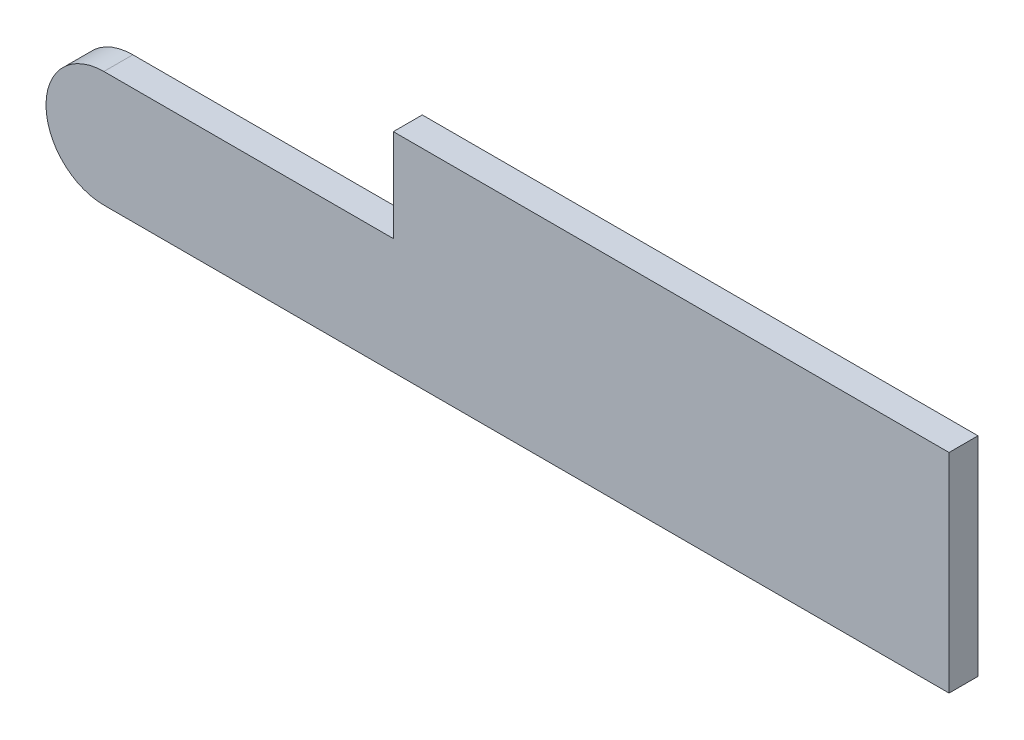
ISO-10303-21;
HEADER;
FILE_DESCRIPTION(('STEP AP214'),'2;1');
FILE_NAME('part.step','',(''),(''),'','','');
FILE_SCHEMA(('AUTOMOTIVE_DESIGN { 1 0 10303 214 1 1 1 1 }'));
ENDSEC;
DATA;
#1=APPLICATION_CONTEXT('core data for automotive mechanical design processes');
#2=APPLICATION_PROTOCOL_DEFINITION('international standard','automotive_design',2000,#1);
#3=PRODUCT_CONTEXT('',#1,'mechanical');
#4=PRODUCT('Part','Part','',(#3));
#5=PRODUCT_RELATED_PRODUCT_CATEGORY('part','',(#4));
#6=PRODUCT_DEFINITION_FORMATION('','',#4);
#7=PRODUCT_DEFINITION_CONTEXT('part definition',#1,'design');
#8=PRODUCT_DEFINITION('design','',#6,#7);
#9=PRODUCT_DEFINITION_SHAPE('','',#8);
#10=(LENGTH_UNIT() NAMED_UNIT(*) SI_UNIT(.MILLI.,.METRE.));
#11=(NAMED_UNIT(*) PLANE_ANGLE_UNIT() SI_UNIT($,.RADIAN.));
#12=(NAMED_UNIT(*) SI_UNIT($,.STERADIAN.) SOLID_ANGLE_UNIT());
#13=UNCERTAINTY_MEASURE_WITH_UNIT(LENGTH_MEASURE(1.E-05),#10,'distance_accuracy_value','');
#14=(GEOMETRIC_REPRESENTATION_CONTEXT(3) GLOBAL_UNCERTAINTY_ASSIGNED_CONTEXT((#13)) GLOBAL_UNIT_ASSIGNED_CONTEXT((#10,
#11,#12)) REPRESENTATION_CONTEXT('',''));
#15=CARTESIAN_POINT('',(0.,0.,0.));
#16=DIRECTION('',(0.,0.,1.));
#17=DIRECTION('',(1.,0.,0.));
#18=AXIS2_PLACEMENT_3D('',#15,#16,#17);
#19=CARTESIAN_POINT('',(0.,0.,-0.25));
#20=DIRECTION('',(0.,0.,1.));
#21=DIRECTION('',(1.,0.,0.));
#22=AXIS2_PLACEMENT_3D('',#19,#20,#21);
#23=PLANE('',#22);
#24=CARTESIAN_POINT('',(-2.5,0.5,-0.25));
#25=DIRECTION('',(0.,0.,1.));
#26=DIRECTION('',(1.,0.,0.));
#27=AXIS2_PLACEMENT_3D('',#24,#25,#26);
#28=CIRCLE('',#27,0.5);
#29=CARTESIAN_POINT('',(-2.5,0.999999999999999,-0.25));
#30=VERTEX_POINT('',#29);
#31=CARTESIAN_POINT('',(-2.5,0.,-0.25));
#32=VERTEX_POINT('',#31);
#33=EDGE_CURVE('E20',#30,#32,#28,.T.);
#34=ORIENTED_EDGE('',*,*,#33,.F.);
#35=DIRECTION('',(1.,0.,0.));
#36=VECTOR('',#35,1.);
#37=CARTESIAN_POINT('',(-3.,0.999999999999999,-0.25));
#38=LINE('',#37,#36);
#39=CARTESIAN_POINT('',(0.,0.999999999999999,-0.25));
#40=VERTEX_POINT('',#39);
#41=EDGE_CURVE('E96',#40,#30,#38,.F.);
#42=ORIENTED_EDGE('',*,*,#41,.F.);
#43=DIRECTION('',(0.,1.,0.));
#44=VECTOR('',#43,1.);
#45=CARTESIAN_POINT('',(0.,0.999999999999999,-0.25));
#46=LINE('',#45,#44);
#47=CARTESIAN_POINT('',(0.,1.8,-0.25));
#48=VERTEX_POINT('',#47);
#49=EDGE_CURVE('E94',#48,#40,#46,.F.);
#50=ORIENTED_EDGE('',*,*,#49,.F.);
#51=DIRECTION('',(-1.,0.,0.));
#52=VECTOR('',#51,1.);
#53=CARTESIAN_POINT('',(0.,1.8,-0.25));
#54=LINE('',#53,#52);
#55=CARTESIAN_POINT('',(4.8,1.8,-0.25));
#56=VERTEX_POINT('',#55);
#57=EDGE_CURVE('E103',#56,#48,#54,.T.);
#58=ORIENTED_EDGE('',*,*,#57,.F.);
#59=DIRECTION('',(0.,1.,0.));
#60=VECTOR('',#59,1.);
#61=CARTESIAN_POINT('',(4.8,0.,-0.25));
#62=LINE('',#61,#60);
#63=CARTESIAN_POINT('',(4.8,0.,-0.25));
#64=VERTEX_POINT('',#63);
#65=EDGE_CURVE('E81',#64,#56,#62,.T.);
#66=ORIENTED_EDGE('',*,*,#65,.F.);
#67=DIRECTION('',(1.,0.,0.));
#68=VECTOR('',#67,1.);
#69=CARTESIAN_POINT('',(0.,0.,-0.25));
#70=LINE('',#69,#68);
#71=EDGE_CURVE('E79',#32,#64,#70,.T.);
#72=ORIENTED_EDGE('',*,*,#71,.F.);
#73=EDGE_LOOP('',(#34,#42,#50,#58,#66,#72));
#74=FACE_BOUND('',#73,.T.);
#75=ADVANCED_FACE('F17',(#74),#23,.F.);
#76=CARTESIAN_POINT('',(-2.5,0.5,-0.25));
#77=DIRECTION('',(0.,0.,1.));
#78=DIRECTION('',(1.,0.,0.));
#79=AXIS2_PLACEMENT_3D('',#76,#77,#78);
#80=CYLINDRICAL_SURFACE('',#79,0.5);
#81=DIRECTION('',(0.,0.,-1.));
#82=VECTOR('',#81,1.);
#83=CARTESIAN_POINT('',(-2.5,0.,-0.25));
#84=LINE('',#83,#82);
#85=CARTESIAN_POINT('',(-2.5,0.,0.));
#86=VERTEX_POINT('',#85);
#87=EDGE_CURVE('E72',#86,#32,#84,.T.);
#88=ORIENTED_EDGE('',*,*,#87,.F.);
#89=CARTESIAN_POINT('',(-2.5,0.499999999999999,0.));
#90=DIRECTION('',(0.,0.,1.));
#91=DIRECTION('',(1.,0.,0.));
#92=AXIS2_PLACEMENT_3D('',#89,#90,#91);
#93=CIRCLE('',#92,0.5);
#94=CARTESIAN_POINT('',(-2.5,0.999999999999999,0.));
#95=VERTEX_POINT('',#94);
#96=EDGE_CURVE('E112',#95,#86,#93,.T.);
#97=ORIENTED_EDGE('',*,*,#96,.F.);
#98=DIRECTION('',(0.,0.,1.));
#99=VECTOR('',#98,1.);
#100=CARTESIAN_POINT('',(-2.5,0.999999999999999,-0.25));
#101=LINE('',#100,#99);
#102=EDGE_CURVE('E75',#30,#95,#101,.T.);
#103=ORIENTED_EDGE('',*,*,#102,.F.);
#104=ORIENTED_EDGE('',*,*,#33,.T.);
#105=EDGE_LOOP('',(#88,#97,#103,#104));
#106=FACE_BOUND('',#105,.T.);
#107=ADVANCED_FACE('F70',(#106),#80,.T.);
#108=CARTESIAN_POINT('',(0.,0.,-0.25));
#109=DIRECTION('',(0.,-1.,0.));
#110=DIRECTION('',(0.,0.,-1.));
#111=AXIS2_PLACEMENT_3D('',#108,#109,#110);
#112=PLANE('',#111);
#113=ORIENTED_EDGE('',*,*,#71,.T.);
#114=DIRECTION('',(0.,0.,-1.));
#115=VECTOR('',#114,1.);
#116=CARTESIAN_POINT('',(4.8,0.,-0.25));
#117=LINE('',#116,#115);
#118=CARTESIAN_POINT('',(4.8,0.,0.));
#119=VERTEX_POINT('',#118);
#120=EDGE_CURVE('E84',#119,#64,#117,.T.);
#121=ORIENTED_EDGE('',*,*,#120,.F.);
#122=DIRECTION('',(1.,0.,0.));
#123=VECTOR('',#122,1.);
#124=CARTESIAN_POINT('',(0.,0.,0.));
#125=LINE('',#124,#123);
#126=EDGE_CURVE('E88',#86,#119,#125,.T.);
#127=ORIENTED_EDGE('',*,*,#126,.F.);
#128=ORIENTED_EDGE('',*,*,#87,.T.);
#129=EDGE_LOOP('',(#113,#121,#127,#128));
#130=FACE_BOUND('',#129,.T.);
#131=ADVANCED_FACE('F86',(#130),#112,.T.);
#132=CARTESIAN_POINT('',(4.8,0.,-0.25));
#133=DIRECTION('',(1.,0.,0.));
#134=DIRECTION('',(0.,0.,-1.));
#135=AXIS2_PLACEMENT_3D('',#132,#133,#134);
#136=PLANE('',#135);
#137=ORIENTED_EDGE('',*,*,#65,.T.);
#138=DIRECTION('',(0.,0.,1.));
#139=VECTOR('',#138,1.);
#140=CARTESIAN_POINT('',(4.8,1.8,-0.25));
#141=LINE('',#140,#139);
#142=CARTESIAN_POINT('',(4.8,1.8,0.));
#143=VERTEX_POINT('',#142);
#144=EDGE_CURVE('E105',#143,#56,#141,.F.);
#145=ORIENTED_EDGE('',*,*,#144,.F.);
#146=DIRECTION('',(0.,1.,0.));
#147=VECTOR('',#146,1.);
#148=CARTESIAN_POINT('',(4.8,0.,0.));
#149=LINE('',#148,#147);
#150=EDGE_CURVE('E114',#119,#143,#149,.T.);
#151=ORIENTED_EDGE('',*,*,#150,.F.);
#152=ORIENTED_EDGE('',*,*,#120,.T.);
#153=EDGE_LOOP('',(#137,#145,#151,#152));
#154=FACE_BOUND('',#153,.T.);
#155=ADVANCED_FACE('F145',(#154),#136,.T.);
#156=CARTESIAN_POINT('',(0.,1.8,-0.25));
#157=DIRECTION('',(0.,1.,0.));
#158=DIRECTION('',(-1.,0.,0.));
#159=AXIS2_PLACEMENT_3D('',#156,#157,#158);
#160=PLANE('',#159);
#161=ORIENTED_EDGE('',*,*,#57,.T.);
#162=DIRECTION('',(0.,0.,1.));
#163=VECTOR('',#162,1.);
#164=CARTESIAN_POINT('',(0.,1.8,-0.25));
#165=LINE('',#164,#163);
#166=CARTESIAN_POINT('',(0.,1.8,0.));
#167=VERTEX_POINT('',#166);
#168=EDGE_CURVE('E97',#167,#48,#165,.F.);
#169=ORIENTED_EDGE('',*,*,#168,.F.);
#170=DIRECTION('',(1.,0.,0.));
#171=VECTOR('',#170,1.);
#172=CARTESIAN_POINT('',(0.,1.8,0.));
#173=LINE('',#172,#171);
#174=EDGE_CURVE('E125',#143,#167,#173,.F.);
#175=ORIENTED_EDGE('',*,*,#174,.F.);
#176=ORIENTED_EDGE('',*,*,#144,.T.);
#177=EDGE_LOOP('',(#161,#169,#175,#176));
#178=FACE_BOUND('',#177,.T.);
#179=ADVANCED_FACE('F160',(#178),#160,.T.);
#180=CARTESIAN_POINT('',(0.,0.999999999999999,-0.25));
#181=DIRECTION('',(-1.,0.,0.));
#182=DIRECTION('',(0.,0.,1.));
#183=AXIS2_PLACEMENT_3D('',#180,#181,#182);
#184=PLANE('',#183);
#185=ORIENTED_EDGE('',*,*,#49,.T.);
#186=DIRECTION('',(0.,0.,1.));
#187=VECTOR('',#186,1.);
#188=CARTESIAN_POINT('',(0.,0.999999999999999,-0.25));
#189=LINE('',#188,#187);
#190=CARTESIAN_POINT('',(0.,0.999999999999999,0.));
#191=VERTEX_POINT('',#190);
#192=EDGE_CURVE('E35',#191,#40,#189,.F.);
#193=ORIENTED_EDGE('',*,*,#192,.F.);
#194=DIRECTION('',(0.,1.,0.));
#195=VECTOR('',#194,1.);
#196=CARTESIAN_POINT('',(0.,0.,0.));
#197=LINE('',#196,#195);
#198=EDGE_CURVE('E26',#167,#191,#197,.F.);
#199=ORIENTED_EDGE('',*,*,#198,.F.);
#200=ORIENTED_EDGE('',*,*,#168,.T.);
#201=EDGE_LOOP('',(#185,#193,#199,#200));
#202=FACE_BOUND('',#201,.T.);
#203=ADVANCED_FACE('F155',(#202),#184,.T.);
#204=CARTESIAN_POINT('',(-3.,0.999999999999999,-0.25));
#205=DIRECTION('',(0.,1.,0.));
#206=DIRECTION('',(0.,0.,1.));
#207=AXIS2_PLACEMENT_3D('',#204,#205,#206);
#208=PLANE('',#207);
#209=DIRECTION('',(1.,0.,0.));
#210=VECTOR('',#209,1.);
#211=CARTESIAN_POINT('',(0.,0.999999999999999,0.));
#212=LINE('',#211,#210);
#213=EDGE_CURVE('E11',#191,#95,#212,.F.);
#214=ORIENTED_EDGE('',*,*,#213,.F.);
#215=ORIENTED_EDGE('',*,*,#192,.T.);
#216=ORIENTED_EDGE('',*,*,#41,.T.);
#217=ORIENTED_EDGE('',*,*,#102,.T.);
#218=EDGE_LOOP('',(#214,#215,#216,#217));
#219=FACE_BOUND('',#218,.T.);
#220=ADVANCED_FACE('F149',(#219),#208,.T.);
#221=CARTESIAN_POINT('',(0.,0.,0.));
#222=DIRECTION('',(0.,0.,1.));
#223=DIRECTION('',(1.,0.,0.));
#224=AXIS2_PLACEMENT_3D('',#221,#222,#223);
#225=PLANE('',#224);
#226=ORIENTED_EDGE('',*,*,#198,.T.);
#227=ORIENTED_EDGE('',*,*,#213,.T.);
#228=ORIENTED_EDGE('',*,*,#96,.T.);
#229=ORIENTED_EDGE('',*,*,#126,.T.);
#230=ORIENTED_EDGE('',*,*,#150,.T.);
#231=ORIENTED_EDGE('',*,*,#174,.T.);
#232=EDGE_LOOP('',(#226,#227,#228,#229,#230,#231));
#233=FACE_BOUND('',#232,.T.);
#234=ADVANCED_FACE('F147',(#233),#225,.T.);
#235=CLOSED_SHELL('',(#75,#107,#131,#155,#179,#203,#220,#234));
#236=MANIFOLD_SOLID_BREP('B1',#235);
#237=ADVANCED_BREP_SHAPE_REPRESENTATION('',(#18,#236),#14);
#238=SHAPE_DEFINITION_REPRESENTATION(#9,#237);
ENDSEC;
END-ISO-10303-21;
